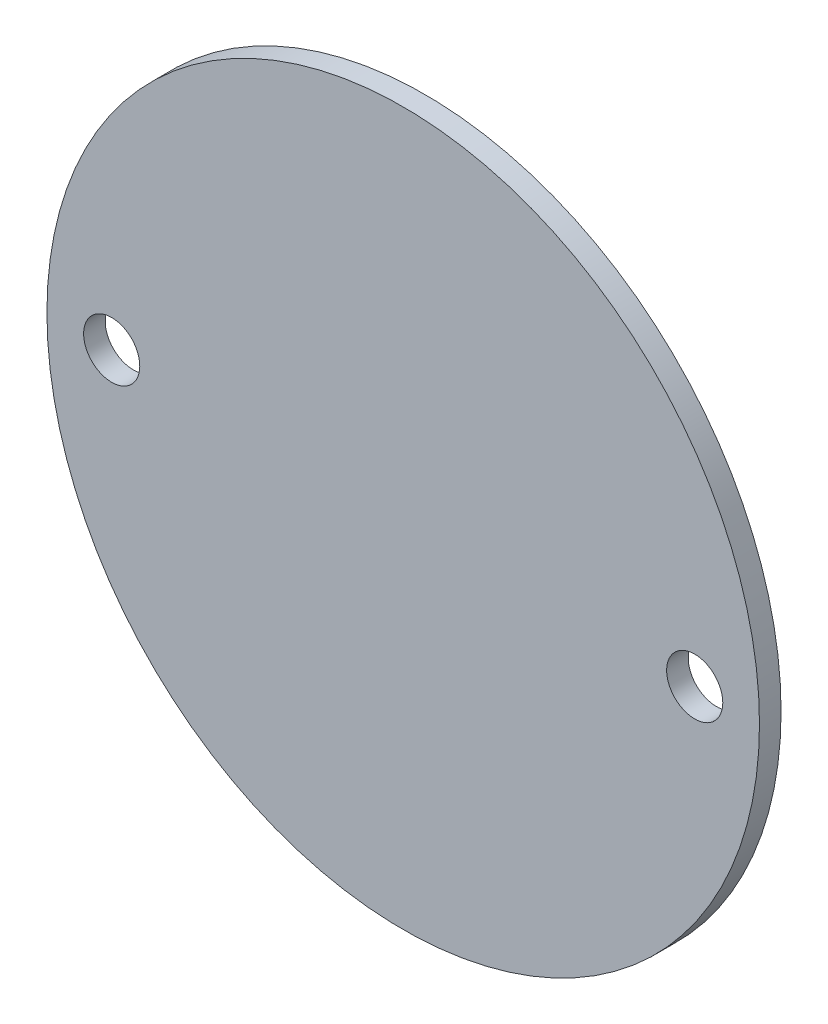
ISO-10303-21;
HEADER;
FILE_DESCRIPTION(('STEP AP214'),'2;1');
FILE_NAME('part.step','',(''),(''),'','','');
FILE_SCHEMA(('AUTOMOTIVE_DESIGN { 1 0 10303 214 1 1 1 1 }'));
ENDSEC;
DATA;
#1=APPLICATION_CONTEXT('core data for automotive mechanical design processes');
#2=APPLICATION_PROTOCOL_DEFINITION('international standard','automotive_design',2000,#1);
#3=PRODUCT_CONTEXT('',#1,'mechanical');
#4=PRODUCT('Part','Part','',(#3));
#5=PRODUCT_RELATED_PRODUCT_CATEGORY('part','',(#4));
#6=PRODUCT_DEFINITION_FORMATION('','',#4);
#7=PRODUCT_DEFINITION_CONTEXT('part definition',#1,'design');
#8=PRODUCT_DEFINITION('design','',#6,#7);
#9=PRODUCT_DEFINITION_SHAPE('','',#8);
#10=(LENGTH_UNIT() NAMED_UNIT(*) SI_UNIT(.MILLI.,.METRE.));
#11=(NAMED_UNIT(*) PLANE_ANGLE_UNIT() SI_UNIT($,.RADIAN.));
#12=(NAMED_UNIT(*) SI_UNIT($,.STERADIAN.) SOLID_ANGLE_UNIT());
#13=UNCERTAINTY_MEASURE_WITH_UNIT(LENGTH_MEASURE(1.E-05),#10,'distance_accuracy_value','');
#14=(GEOMETRIC_REPRESENTATION_CONTEXT(3) GLOBAL_UNCERTAINTY_ASSIGNED_CONTEXT((#13)) GLOBAL_UNIT_ASSIGNED_CONTEXT((#10,
#11,#12)) REPRESENTATION_CONTEXT('',''));
#15=CARTESIAN_POINT('',(0.,0.,0.));
#16=DIRECTION('',(0.,0.,1.));
#17=DIRECTION('',(1.,0.,0.));
#18=AXIS2_PLACEMENT_3D('',#15,#16,#17);
#19=CARTESIAN_POINT('',(0.,0.,2.));
#20=DIRECTION('',(0.,0.,1.));
#21=DIRECTION('',(1.,0.,0.));
#22=AXIS2_PLACEMENT_3D('',#19,#20,#21);
#23=PLANE('',#22);
#24=CARTESIAN_POINT('',(27.,0.,2.));
#25=DIRECTION('',(0.,0.,1.));
#26=DIRECTION('',(1.,0.,0.));
#27=AXIS2_PLACEMENT_3D('',#24,#25,#26);
#28=CIRCLE('',#27,2.6);
#29=CARTESIAN_POINT('',(29.6,0.,2.));
#30=VERTEX_POINT('',#29);
#31=EDGE_CURVE('E50',#30,#30,#28,.T.);
#32=ORIENTED_EDGE('',*,*,#31,.F.);
#33=EDGE_LOOP('',(#32));
#34=FACE_BOUND('',#33,.T.);
#35=CARTESIAN_POINT('',(0.,0.,2.));
#36=DIRECTION('',(0.,0.,1.));
#37=DIRECTION('',(1.,0.,0.));
#38=AXIS2_PLACEMENT_3D('',#35,#36,#37);
#39=CIRCLE('',#38,33.);
#40=CARTESIAN_POINT('',(33.,0.,2.));
#41=VERTEX_POINT('',#40);
#42=EDGE_CURVE('E10',#41,#41,#39,.T.);
#43=ORIENTED_EDGE('',*,*,#42,.T.);
#44=EDGE_LOOP('',(#43));
#45=FACE_BOUND('',#44,.T.);
#46=CARTESIAN_POINT('',(-27.,0.,2.));
#47=DIRECTION('',(0.,0.,1.));
#48=DIRECTION('',(1.,0.,0.));
#49=AXIS2_PLACEMENT_3D('',#46,#47,#48);
#50=CIRCLE('',#49,2.6);
#51=CARTESIAN_POINT('',(-24.4,0.,2.));
#52=VERTEX_POINT('',#51);
#53=EDGE_CURVE('E56',#52,#52,#50,.T.);
#54=ORIENTED_EDGE('',*,*,#53,.F.);
#55=EDGE_LOOP('',(#54));
#56=FACE_BOUND('',#55,.T.);
#57=ADVANCED_FACE('F37',(#34,#45,#56),#23,.T.);
#58=CARTESIAN_POINT('',(0.,0.,0.));
#59=DIRECTION('',(0.,0.,1.));
#60=DIRECTION('',(1.,0.,0.));
#61=AXIS2_PLACEMENT_3D('',#58,#59,#60);
#62=PLANE('',#61);
#63=CARTESIAN_POINT('',(0.,0.,0.));
#64=DIRECTION('',(0.,0.,1.));
#65=DIRECTION('',(1.,0.,0.));
#66=AXIS2_PLACEMENT_3D('',#63,#64,#65);
#67=CIRCLE('',#66,33.);
#68=CARTESIAN_POINT('',(33.,0.,0.));
#69=VERTEX_POINT('',#68);
#70=EDGE_CURVE('E41',#69,#69,#67,.T.);
#71=ORIENTED_EDGE('',*,*,#70,.F.);
#72=EDGE_LOOP('',(#71));
#73=FACE_BOUND('',#72,.T.);
#74=CARTESIAN_POINT('',(27.,0.,0.));
#75=DIRECTION('',(0.,0.,1.));
#76=DIRECTION('',(1.,0.,0.));
#77=AXIS2_PLACEMENT_3D('',#74,#75,#76);
#78=CIRCLE('',#77,2.6);
#79=CARTESIAN_POINT('',(29.6,0.,0.));
#80=VERTEX_POINT('',#79);
#81=EDGE_CURVE('E52',#80,#80,#78,.T.);
#82=ORIENTED_EDGE('',*,*,#81,.T.);
#83=EDGE_LOOP('',(#82));
#84=FACE_BOUND('',#83,.T.);
#85=CARTESIAN_POINT('',(-27.,0.,0.));
#86=DIRECTION('',(0.,0.,1.));
#87=DIRECTION('',(1.,0.,0.));
#88=AXIS2_PLACEMENT_3D('',#85,#86,#87);
#89=CIRCLE('',#88,2.6);
#90=CARTESIAN_POINT('',(-24.4,0.,0.));
#91=VERTEX_POINT('',#90);
#92=EDGE_CURVE('E60',#91,#91,#89,.T.);
#93=ORIENTED_EDGE('',*,*,#92,.T.);
#94=EDGE_LOOP('',(#93));
#95=FACE_BOUND('',#94,.T.);
#96=ADVANCED_FACE('F72',(#73,#84,#95),#62,.F.);
#97=CARTESIAN_POINT('',(0.,0.,2.));
#98=DIRECTION('',(0.,0.,-1.));
#99=DIRECTION('',(-1.,0.,0.));
#100=AXIS2_PLACEMENT_3D('',#97,#98,#99);
#101=CYLINDRICAL_SURFACE('',#100,33.);
#102=ORIENTED_EDGE('',*,*,#42,.F.);
#103=EDGE_LOOP('',(#102));
#104=FACE_BOUND('',#103,.T.);
#105=ORIENTED_EDGE('',*,*,#70,.T.);
#106=EDGE_LOOP('',(#105));
#107=FACE_BOUND('',#106,.T.);
#108=ADVANCED_FACE('F39',(#104,#107),#101,.T.);
#109=CARTESIAN_POINT('',(27.,0.,2.));
#110=DIRECTION('',(0.,0.,-1.));
#111=DIRECTION('',(-1.,0.,0.));
#112=AXIS2_PLACEMENT_3D('',#109,#110,#111);
#113=CYLINDRICAL_SURFACE('',#112,2.6);
#114=ORIENTED_EDGE('',*,*,#31,.T.);
#115=EDGE_LOOP('',(#114));
#116=FACE_BOUND('',#115,.T.);
#117=ORIENTED_EDGE('',*,*,#81,.F.);
#118=EDGE_LOOP('',(#117));
#119=FACE_BOUND('',#118,.T.);
#120=ADVANCED_FACE('F81',(#116,#119),#113,.F.);
#121=CARTESIAN_POINT('',(-27.,0.,2.));
#122=DIRECTION('',(0.,0.,-1.));
#123=DIRECTION('',(-1.,0.,0.));
#124=AXIS2_PLACEMENT_3D('',#121,#122,#123);
#125=CYLINDRICAL_SURFACE('',#124,2.6);
#126=ORIENTED_EDGE('',*,*,#53,.T.);
#127=EDGE_LOOP('',(#126));
#128=FACE_BOUND('',#127,.T.);
#129=ORIENTED_EDGE('',*,*,#92,.F.);
#130=EDGE_LOOP('',(#129));
#131=FACE_BOUND('',#130,.T.);
#132=ADVANCED_FACE('F68',(#128,#131),#125,.F.);
#133=CLOSED_SHELL('',(#57,#96,#108,#120,#132));
#134=MANIFOLD_SOLID_BREP('B2',#133);
#135=ADVANCED_BREP_SHAPE_REPRESENTATION('',(#18,#134),#14);
#136=SHAPE_DEFINITION_REPRESENTATION(#9,#135);
ENDSEC;
END-ISO-10303-21;
